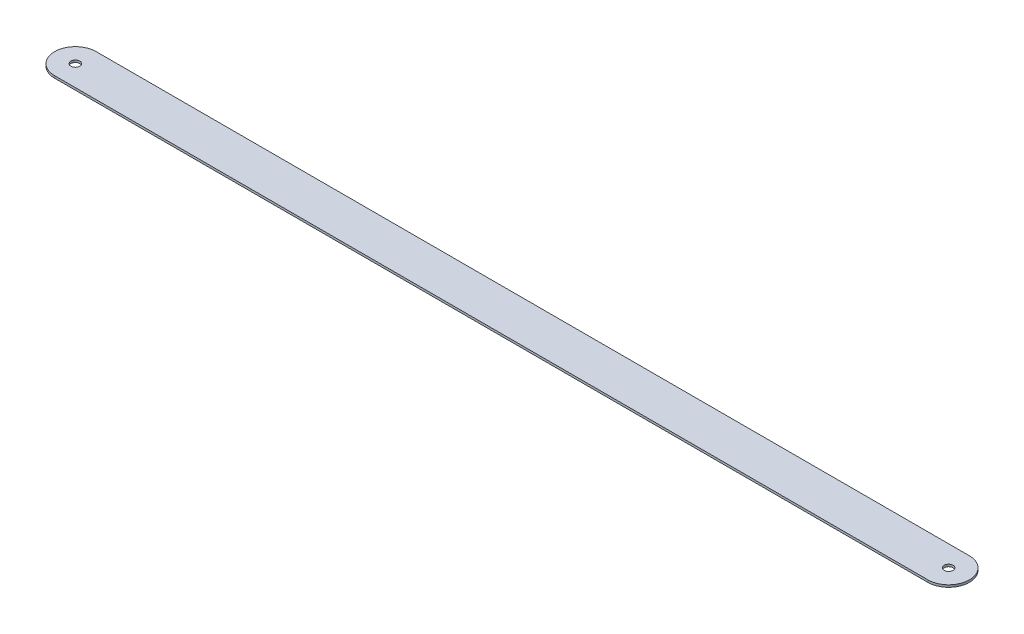
ISO-10303-21;
HEADER;
FILE_DESCRIPTION(('STEP AP214'),'2;1');
FILE_NAME('part.step','',(''),(''),'','','');
FILE_SCHEMA(('AUTOMOTIVE_DESIGN { 1 0 10303 214 1 1 1 1 }'));
ENDSEC;
DATA;
#1=APPLICATION_CONTEXT('core data for automotive mechanical design processes');
#2=APPLICATION_PROTOCOL_DEFINITION('international standard','automotive_design',2000,#1);
#3=PRODUCT_CONTEXT('',#1,'mechanical');
#4=PRODUCT('Part','Part','',(#3));
#5=PRODUCT_RELATED_PRODUCT_CATEGORY('part','',(#4));
#6=PRODUCT_DEFINITION_FORMATION('','',#4);
#7=PRODUCT_DEFINITION_CONTEXT('part definition',#1,'design');
#8=PRODUCT_DEFINITION('design','',#6,#7);
#9=PRODUCT_DEFINITION_SHAPE('','',#8);
#10=(LENGTH_UNIT() NAMED_UNIT(*) SI_UNIT(.MILLI.,.METRE.));
#11=(NAMED_UNIT(*) PLANE_ANGLE_UNIT() SI_UNIT($,.RADIAN.));
#12=(NAMED_UNIT(*) SI_UNIT($,.STERADIAN.) SOLID_ANGLE_UNIT());
#13=UNCERTAINTY_MEASURE_WITH_UNIT(LENGTH_MEASURE(1.E-05),#10,'distance_accuracy_value','');
#14=(GEOMETRIC_REPRESENTATION_CONTEXT(3) GLOBAL_UNCERTAINTY_ASSIGNED_CONTEXT((#13)) GLOBAL_UNIT_ASSIGNED_CONTEXT((#10,
#11,#12)) REPRESENTATION_CONTEXT('',''));
#15=CARTESIAN_POINT('',(0.,0.,0.));
#16=DIRECTION('',(0.,0.,1.));
#17=DIRECTION('',(1.,0.,0.));
#18=AXIS2_PLACEMENT_3D('',#15,#16,#17);
#19=CARTESIAN_POINT('',(0.,1.5,0.));
#20=DIRECTION('',(0.,1.,0.));
#21=DIRECTION('',(0.,0.,1.));
#22=AXIS2_PLACEMENT_3D('',#19,#20,#21);
#23=PLANE('',#22);
#24=CARTESIAN_POINT('',(0.,1.5,0.));
#25=DIRECTION('',(0.,1.,0.));
#26=DIRECTION('',(0.,0.,1.));
#27=AXIS2_PLACEMENT_3D('',#24,#25,#26);
#28=CIRCLE('',#27,3.);
#29=CARTESIAN_POINT('',(0.,1.5,3.));
#30=VERTEX_POINT('',#29);
#31=EDGE_CURVE('E101',#30,#30,#28,.T.);
#32=ORIENTED_EDGE('',*,*,#31,.F.);
#33=EDGE_LOOP('',(#32));
#34=FACE_BOUND('',#33,.T.);
#35=CARTESIAN_POINT('',(0.,1.5,0.));
#36=DIRECTION('',(0.,1.,0.));
#37=DIRECTION('',(0.,0.,1.));
#38=AXIS2_PLACEMENT_3D('',#35,#36,#37);
#39=CIRCLE('',#38,14.);
#40=CARTESIAN_POINT('',(0.,1.5,-14.));
#41=VERTEX_POINT('',#40);
#42=CARTESIAN_POINT('',(0.,1.5,14.));
#43=VERTEX_POINT('',#42);
#44=EDGE_CURVE('E86',#41,#43,#39,.T.);
#45=ORIENTED_EDGE('',*,*,#44,.T.);
#46=DIRECTION('',(1.,0.,0.));
#47=VECTOR('',#46,1.);
#48=CARTESIAN_POINT('',(0.,1.5,14.));
#49=LINE('',#48,#47);
#50=CARTESIAN_POINT('',(587.63,1.5,14.));
#51=VERTEX_POINT('',#50);
#52=EDGE_CURVE('E81',#43,#51,#49,.T.);
#53=ORIENTED_EDGE('',*,*,#52,.T.);
#54=CARTESIAN_POINT('',(587.63,1.5,0.));
#55=DIRECTION('',(0.,1.,0.));
#56=DIRECTION('',(0.,0.,1.));
#57=AXIS2_PLACEMENT_3D('',#54,#55,#56);
#58=CIRCLE('',#57,14.);
#59=CARTESIAN_POINT('',(587.63,1.5,-14.));
#60=VERTEX_POINT('',#59);
#61=EDGE_CURVE('E84',#51,#60,#58,.T.);
#62=ORIENTED_EDGE('',*,*,#61,.T.);
#63=DIRECTION('',(-1.,0.,0.));
#64=VECTOR('',#63,1.);
#65=CARTESIAN_POINT('',(0.,1.5,-14.));
#66=LINE('',#65,#64);
#67=EDGE_CURVE('E51',#60,#41,#66,.T.);
#68=ORIENTED_EDGE('',*,*,#67,.T.);
#69=EDGE_LOOP('',(#45,#53,#62,#68));
#70=FACE_BOUND('',#69,.T.);
#71=CARTESIAN_POINT('',(587.63,1.5,0.));
#72=DIRECTION('',(0.,1.,0.));
#73=DIRECTION('',(0.,0.,1.));
#74=AXIS2_PLACEMENT_3D('',#71,#72,#73);
#75=CIRCLE('',#74,3.00000000000005);
#76=CARTESIAN_POINT('',(587.63,1.5,3.00000000000005));
#77=VERTEX_POINT('',#76);
#78=EDGE_CURVE('E116',#77,#77,#75,.T.);
#79=ORIENTED_EDGE('',*,*,#78,.F.);
#80=EDGE_LOOP('',(#79));
#81=FACE_BOUND('',#80,.T.);
#82=ADVANCED_FACE('F34',(#34,#70,#81),#23,.T.);
#83=CARTESIAN_POINT('',(0.,0.,0.));
#84=DIRECTION('',(0.,1.,0.));
#85=DIRECTION('',(0.,0.,1.));
#86=AXIS2_PLACEMENT_3D('',#83,#84,#85);
#87=PLANE('',#86);
#88=CARTESIAN_POINT('',(0.,0.,0.));
#89=DIRECTION('',(0.,1.,0.));
#90=DIRECTION('',(0.,0.,1.));
#91=AXIS2_PLACEMENT_3D('',#88,#89,#90);
#92=CIRCLE('',#91,14.);
#93=CARTESIAN_POINT('',(0.,0.,-14.));
#94=VERTEX_POINT('',#93);
#95=CARTESIAN_POINT('',(0.,0.,14.));
#96=VERTEX_POINT('',#95);
#97=EDGE_CURVE('E98',#94,#96,#92,.T.);
#98=ORIENTED_EDGE('',*,*,#97,.F.);
#99=DIRECTION('',(-1.,0.,0.));
#100=VECTOR('',#99,1.);
#101=CARTESIAN_POINT('',(0.,0.,-14.));
#102=LINE('',#101,#100);
#103=CARTESIAN_POINT('',(587.63,0.,-14.));
#104=VERTEX_POINT('',#103);
#105=EDGE_CURVE('E74',#104,#94,#102,.T.);
#106=ORIENTED_EDGE('',*,*,#105,.F.);
#107=CARTESIAN_POINT('',(587.63,0.,0.));
#108=DIRECTION('',(0.,1.,0.));
#109=DIRECTION('',(0.,0.,1.));
#110=AXIS2_PLACEMENT_3D('',#107,#108,#109);
#111=CIRCLE('',#110,14.);
#112=CARTESIAN_POINT('',(587.63,0.,14.));
#113=VERTEX_POINT('',#112);
#114=EDGE_CURVE('E68',#113,#104,#111,.T.);
#115=ORIENTED_EDGE('',*,*,#114,.F.);
#116=DIRECTION('',(1.,0.,0.));
#117=VECTOR('',#116,1.);
#118=CARTESIAN_POINT('',(0.,0.,14.));
#119=LINE('',#118,#117);
#120=EDGE_CURVE('E90',#96,#113,#119,.T.);
#121=ORIENTED_EDGE('',*,*,#120,.F.);
#122=EDGE_LOOP('',(#98,#106,#115,#121));
#123=FACE_BOUND('',#122,.T.);
#124=CARTESIAN_POINT('',(0.,0.,0.));
#125=DIRECTION('',(0.,1.,0.));
#126=DIRECTION('',(0.,0.,1.));
#127=AXIS2_PLACEMENT_3D('',#124,#125,#126);
#128=CIRCLE('',#127,3.);
#129=CARTESIAN_POINT('',(0.,0.,3.));
#130=VERTEX_POINT('',#129);
#131=EDGE_CURVE('E113',#130,#130,#128,.T.);
#132=ORIENTED_EDGE('',*,*,#131,.T.);
#133=EDGE_LOOP('',(#132));
#134=FACE_BOUND('',#133,.T.);
#135=CARTESIAN_POINT('',(587.63,0.,0.));
#136=DIRECTION('',(0.,1.,0.));
#137=DIRECTION('',(0.,0.,1.));
#138=AXIS2_PLACEMENT_3D('',#135,#136,#137);
#139=CIRCLE('',#138,3.00000000000005);
#140=CARTESIAN_POINT('',(587.63,0.,3.00000000000005));
#141=VERTEX_POINT('',#140);
#142=EDGE_CURVE('E119',#141,#141,#139,.T.);
#143=ORIENTED_EDGE('',*,*,#142,.T.);
#144=EDGE_LOOP('',(#143));
#145=FACE_BOUND('',#144,.T.);
#146=ADVANCED_FACE('F109',(#123,#134,#145),#87,.F.);
#147=CARTESIAN_POINT('',(0.,1.5,0.));
#148=DIRECTION('',(0.,-1.,0.));
#149=DIRECTION('',(0.,0.,-1.));
#150=AXIS2_PLACEMENT_3D('',#147,#148,#149);
#151=CYLINDRICAL_SURFACE('',#150,14.);
#152=ORIENTED_EDGE('',*,*,#97,.T.);
#153=DIRECTION('',(0.,-1.,0.));
#154=VECTOR('',#153,1.);
#155=CARTESIAN_POINT('',(0.,1.5,14.));
#156=LINE('',#155,#154);
#157=EDGE_CURVE('E11',#43,#96,#156,.T.);
#158=ORIENTED_EDGE('',*,*,#157,.F.);
#159=ORIENTED_EDGE('',*,*,#44,.F.);
#160=DIRECTION('',(0.,-1.,0.));
#161=VECTOR('',#160,1.);
#162=CARTESIAN_POINT('',(0.,1.5,-14.));
#163=LINE('',#162,#161);
#164=EDGE_CURVE('E94',#41,#94,#163,.T.);
#165=ORIENTED_EDGE('',*,*,#164,.T.);
#166=EDGE_LOOP('',(#152,#158,#159,#165));
#167=FACE_BOUND('',#166,.T.);
#168=ADVANCED_FACE('F36',(#167),#151,.T.);
#169=CARTESIAN_POINT('',(0.,1.5,14.));
#170=DIRECTION('',(0.,0.,-1.));
#171=DIRECTION('',(-1.,0.,0.));
#172=AXIS2_PLACEMENT_3D('',#169,#170,#171);
#173=PLANE('',#172);
#174=ORIENTED_EDGE('',*,*,#120,.T.);
#175=DIRECTION('',(0.,-1.,0.));
#176=VECTOR('',#175,1.);
#177=CARTESIAN_POINT('',(587.63,1.5,14.));
#178=LINE('',#177,#176);
#179=EDGE_CURVE('E43',#51,#113,#178,.T.);
#180=ORIENTED_EDGE('',*,*,#179,.F.);
#181=ORIENTED_EDGE('',*,*,#52,.F.);
#182=ORIENTED_EDGE('',*,*,#157,.T.);
#183=EDGE_LOOP('',(#174,#180,#181,#182));
#184=FACE_BOUND('',#183,.T.);
#185=ADVANCED_FACE('F89',(#184),#173,.F.);
#186=CARTESIAN_POINT('',(587.63,1.5,0.));
#187=DIRECTION('',(0.,-1.,0.));
#188=DIRECTION('',(0.,0.,-1.));
#189=AXIS2_PLACEMENT_3D('',#186,#187,#188);
#190=CYLINDRICAL_SURFACE('',#189,14.);
#191=ORIENTED_EDGE('',*,*,#114,.T.);
#192=DIRECTION('',(0.,-1.,0.));
#193=VECTOR('',#192,1.);
#194=CARTESIAN_POINT('',(587.63,1.5,-14.));
#195=LINE('',#194,#193);
#196=EDGE_CURVE('E91',#60,#104,#195,.T.);
#197=ORIENTED_EDGE('',*,*,#196,.F.);
#198=ORIENTED_EDGE('',*,*,#61,.F.);
#199=ORIENTED_EDGE('',*,*,#179,.T.);
#200=EDGE_LOOP('',(#191,#197,#198,#199));
#201=FACE_BOUND('',#200,.T.);
#202=ADVANCED_FACE('F92',(#201),#190,.T.);
#203=CARTESIAN_POINT('',(0.,1.5,-14.));
#204=DIRECTION('',(0.,0.,1.));
#205=DIRECTION('',(1.,0.,0.));
#206=AXIS2_PLACEMENT_3D('',#203,#204,#205);
#207=PLANE('',#206);
#208=ORIENTED_EDGE('',*,*,#105,.T.);
#209=ORIENTED_EDGE('',*,*,#164,.F.);
#210=ORIENTED_EDGE('',*,*,#67,.F.);
#211=ORIENTED_EDGE('',*,*,#196,.T.);
#212=EDGE_LOOP('',(#208,#209,#210,#211));
#213=FACE_BOUND('',#212,.T.);
#214=ADVANCED_FACE('F106',(#213),#207,.F.);
#215=CARTESIAN_POINT('',(0.,1.5,0.));
#216=DIRECTION('',(0.,-1.,0.));
#217=DIRECTION('',(0.,0.,-1.));
#218=AXIS2_PLACEMENT_3D('',#215,#216,#217);
#219=CYLINDRICAL_SURFACE('',#218,3.);
#220=ORIENTED_EDGE('',*,*,#31,.T.);
#221=EDGE_LOOP('',(#220));
#222=FACE_BOUND('',#221,.T.);
#223=ORIENTED_EDGE('',*,*,#131,.F.);
#224=EDGE_LOOP('',(#223));
#225=FACE_BOUND('',#224,.T.);
#226=ADVANCED_FACE('F136',(#222,#225),#219,.F.);
#227=CARTESIAN_POINT('',(587.63,1.5,0.));
#228=DIRECTION('',(0.,-1.,0.));
#229=DIRECTION('',(0.,0.,-1.));
#230=AXIS2_PLACEMENT_3D('',#227,#228,#229);
#231=CYLINDRICAL_SURFACE('',#230,3.00000000000005);
#232=ORIENTED_EDGE('',*,*,#78,.T.);
#233=EDGE_LOOP('',(#232));
#234=FACE_BOUND('',#233,.T.);
#235=ORIENTED_EDGE('',*,*,#142,.F.);
#236=EDGE_LOOP('',(#235));
#237=FACE_BOUND('',#236,.T.);
#238=ADVANCED_FACE('F125',(#234,#237),#231,.F.);
#239=CLOSED_SHELL('',(#82,#146,#168,#185,#202,#214,#226,#238));
#240=MANIFOLD_SOLID_BREP('B2',#239);
#241=ADVANCED_BREP_SHAPE_REPRESENTATION('',(#18,#240),#14);
#242=SHAPE_DEFINITION_REPRESENTATION(#9,#241);
ENDSEC;
END-ISO-10303-21;
